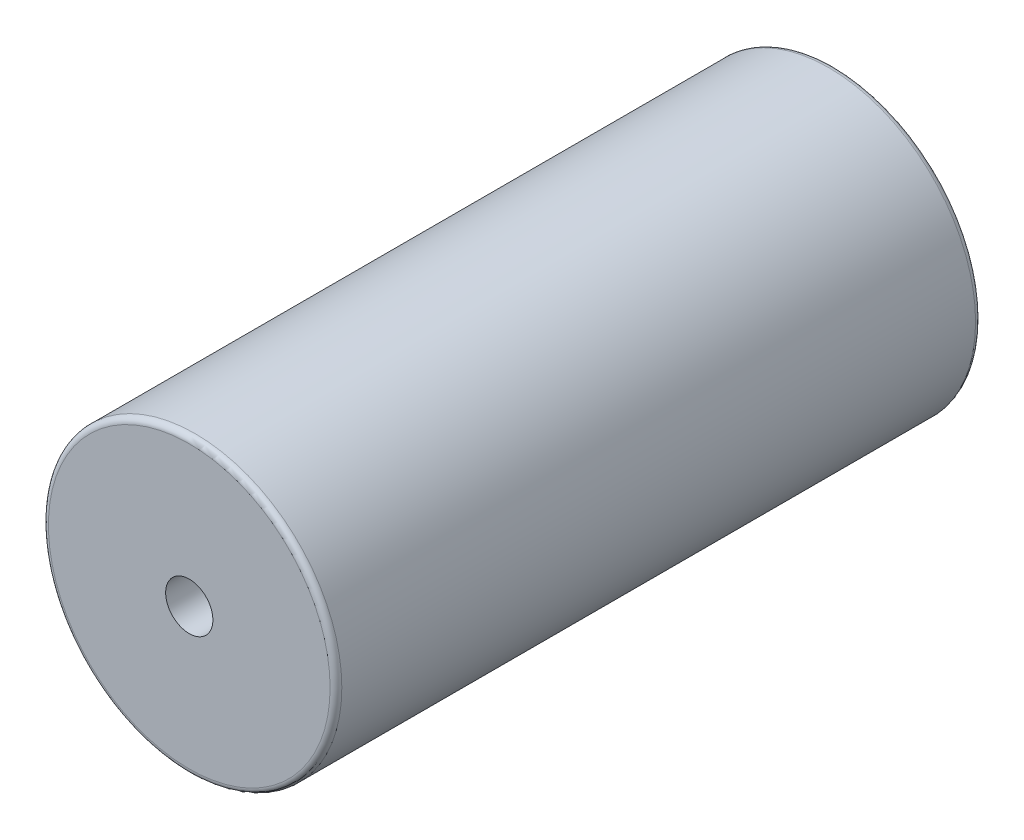
ISO-10303-21;
HEADER;
FILE_DESCRIPTION(('STEP AP214'),'2;1');
FILE_NAME('part.step','',(''),(''),'','','');
FILE_SCHEMA(('AUTOMOTIVE_DESIGN { 1 0 10303 214 1 1 1 1 }'));
ENDSEC;
DATA;
#1=APPLICATION_CONTEXT('core data for automotive mechanical design processes');
#2=APPLICATION_PROTOCOL_DEFINITION('international standard','automotive_design',2000,#1);
#3=PRODUCT_CONTEXT('',#1,'mechanical');
#4=PRODUCT('Part','Part','',(#3));
#5=PRODUCT_RELATED_PRODUCT_CATEGORY('part','',(#4));
#6=PRODUCT_DEFINITION_FORMATION('','',#4);
#7=PRODUCT_DEFINITION_CONTEXT('part definition',#1,'design');
#8=PRODUCT_DEFINITION('design','',#6,#7);
#9=PRODUCT_DEFINITION_SHAPE('','',#8);
#10=(LENGTH_UNIT() NAMED_UNIT(*) SI_UNIT(.MILLI.,.METRE.));
#11=(NAMED_UNIT(*) PLANE_ANGLE_UNIT() SI_UNIT($,.RADIAN.));
#12=(NAMED_UNIT(*) SI_UNIT($,.STERADIAN.) SOLID_ANGLE_UNIT());
#13=UNCERTAINTY_MEASURE_WITH_UNIT(LENGTH_MEASURE(1.E-05),#10,'distance_accuracy_value','');
#14=(GEOMETRIC_REPRESENTATION_CONTEXT(3) GLOBAL_UNCERTAINTY_ASSIGNED_CONTEXT((#13)) GLOBAL_UNIT_ASSIGNED_CONTEXT((#10,
#11,#12)) REPRESENTATION_CONTEXT('',''));
#15=CARTESIAN_POINT('',(0.,0.,0.));
#16=DIRECTION('',(0.,0.,1.));
#17=DIRECTION('',(1.,0.,0.));
#18=AXIS2_PLACEMENT_3D('',#15,#16,#17);
#19=CARTESIAN_POINT('',(0.,0.,110.));
#20=DIRECTION('',(0.,0.,1.));
#21=DIRECTION('',(1.,0.,0.));
#22=AXIS2_PLACEMENT_3D('',#19,#20,#21);
#23=PLANE('',#22);
#24=CARTESIAN_POINT('',(0.,0.,110.));
#25=DIRECTION('',(0.,0.,1.));
#26=DIRECTION('',(1.,0.,0.));
#27=AXIS2_PLACEMENT_3D('',#24,#25,#26);
#28=CIRCLE('',#27,24.);
#29=CARTESIAN_POINT('',(24.,0.,110.));
#30=VERTEX_POINT('',#29);
#31=EDGE_CURVE('E10',#30,#30,#28,.T.);
#32=ORIENTED_EDGE('',*,*,#31,.T.);
#33=EDGE_LOOP('',(#32));
#34=FACE_BOUND('',#33,.T.);
#35=CARTESIAN_POINT('',(0.,0.,110.));
#36=DIRECTION('',(0.,0.,1.));
#37=DIRECTION('',(1.,0.,0.));
#38=AXIS2_PLACEMENT_3D('',#35,#36,#37);
#39=CIRCLE('',#38,4.025);
#40=CARTESIAN_POINT('',(4.025,0.,110.));
#41=VERTEX_POINT('',#40);
#42=EDGE_CURVE('E51',#41,#41,#39,.T.);
#43=ORIENTED_EDGE('',*,*,#42,.F.);
#44=EDGE_LOOP('',(#43));
#45=FACE_BOUND('',#44,.T.);
#46=ADVANCED_FACE('F31',(#34,#45),#23,.T.);
#47=CARTESIAN_POINT('',(0.,0.,0.));
#48=DIRECTION('',(0.,0.,1.));
#49=DIRECTION('',(1.,0.,0.));
#50=AXIS2_PLACEMENT_3D('',#47,#48,#49);
#51=PLANE('',#50);
#52=CARTESIAN_POINT('',(0.,0.,0.));
#53=DIRECTION('',(0.,0.,1.));
#54=DIRECTION('',(1.,0.,0.));
#55=AXIS2_PLACEMENT_3D('',#52,#53,#54);
#56=CIRCLE('',#55,24.);
#57=CARTESIAN_POINT('',(24.,0.,0.));
#58=VERTEX_POINT('',#57);
#59=EDGE_CURVE('E38',#58,#58,#56,.F.);
#60=ORIENTED_EDGE('',*,*,#59,.T.);
#61=EDGE_LOOP('',(#60));
#62=FACE_BOUND('',#61,.T.);
#63=CARTESIAN_POINT('',(0.,0.,0.));
#64=DIRECTION('',(0.,0.,1.));
#65=DIRECTION('',(1.,0.,0.));
#66=AXIS2_PLACEMENT_3D('',#63,#64,#65);
#67=CIRCLE('',#66,4.025);
#68=CARTESIAN_POINT('',(4.025,0.,0.));
#69=VERTEX_POINT('',#68);
#70=EDGE_CURVE('E52',#69,#69,#67,.T.);
#71=ORIENTED_EDGE('',*,*,#70,.T.);
#72=EDGE_LOOP('',(#71));
#73=FACE_BOUND('',#72,.T.);
#74=ADVANCED_FACE('F62',(#62,#73),#51,.F.);
#75=CARTESIAN_POINT('',(0.,0.,110.));
#76=DIRECTION('',(0.,0.,-1.));
#77=DIRECTION('',(-1.,0.,0.));
#78=AXIS2_PLACEMENT_3D('',#75,#76,#77);
#79=CYLINDRICAL_SURFACE('',#78,25.);
#80=CARTESIAN_POINT('',(0.,0.,1.));
#81=DIRECTION('',(0.,0.,1.));
#82=DIRECTION('',(1.,0.,0.));
#83=AXIS2_PLACEMENT_3D('',#80,#81,#82);
#84=CIRCLE('',#83,25.);
#85=CARTESIAN_POINT('',(25.,0.,1.));
#86=VERTEX_POINT('',#85);
#87=EDGE_CURVE('E42',#86,#86,#84,.T.);
#88=ORIENTED_EDGE('',*,*,#87,.T.);
#89=EDGE_LOOP('',(#88));
#90=FACE_BOUND('',#89,.T.);
#91=CARTESIAN_POINT('',(0.,0.,109.));
#92=DIRECTION('',(0.,0.,1.));
#93=DIRECTION('',(1.,0.,0.));
#94=AXIS2_PLACEMENT_3D('',#91,#92,#93);
#95=CIRCLE('',#94,25.);
#96=CARTESIAN_POINT('',(25.,0.,109.));
#97=VERTEX_POINT('',#96);
#98=EDGE_CURVE('E46',#97,#97,#95,.F.);
#99=ORIENTED_EDGE('',*,*,#98,.T.);
#100=EDGE_LOOP('',(#99));
#101=FACE_BOUND('',#100,.T.);
#102=ADVANCED_FACE('F68',(#90,#101),#79,.T.);
#103=CARTESIAN_POINT('',(0.,0.,110.));
#104=DIRECTION('',(0.,0.,-1.));
#105=DIRECTION('',(-1.,0.,0.));
#106=AXIS2_PLACEMENT_3D('',#103,#104,#105);
#107=CYLINDRICAL_SURFACE('',#106,4.025);
#108=ORIENTED_EDGE('',*,*,#42,.T.);
#109=EDGE_LOOP('',(#108));
#110=FACE_BOUND('',#109,.T.);
#111=ORIENTED_EDGE('',*,*,#70,.F.);
#112=EDGE_LOOP('',(#111));
#113=FACE_BOUND('',#112,.T.);
#114=ADVANCED_FACE('F58',(#110,#113),#107,.F.);
#115=CARTESIAN_POINT('',(0.,0.,1.));
#116=DIRECTION('',(0.,0.,1.));
#117=DIRECTION('',(1.,0.,0.));
#118=AXIS2_PLACEMENT_3D('',#115,#116,#117);
#119=TOROIDAL_SURFACE('',#118,24.,1.);
#120=ORIENTED_EDGE('',*,*,#59,.F.);
#121=EDGE_LOOP('',(#120));
#122=FACE_BOUND('',#121,.T.);
#123=ORIENTED_EDGE('',*,*,#87,.F.);
#124=EDGE_LOOP('',(#123));
#125=FACE_BOUND('',#124,.T.);
#126=ADVANCED_FACE('F74',(#122,#125),#119,.T.);
#127=CARTESIAN_POINT('',(0.,0.,109.));
#128=DIRECTION('',(0.,0.,1.));
#129=DIRECTION('',(1.,0.,0.));
#130=AXIS2_PLACEMENT_3D('',#127,#128,#129);
#131=TOROIDAL_SURFACE('',#130,24.,1.);
#132=ORIENTED_EDGE('',*,*,#98,.F.);
#133=EDGE_LOOP('',(#132));
#134=FACE_BOUND('',#133,.T.);
#135=ORIENTED_EDGE('',*,*,#31,.F.);
#136=EDGE_LOOP('',(#135));
#137=FACE_BOUND('',#136,.T.);
#138=ADVANCED_FACE('F33',(#134,#137),#131,.T.);
#139=CLOSED_SHELL('',(#46,#74,#102,#114,#126,#138));
#140=MANIFOLD_SOLID_BREP('B2',#139);
#141=ADVANCED_BREP_SHAPE_REPRESENTATION('',(#18,#140),#14);
#142=SHAPE_DEFINITION_REPRESENTATION(#9,#141);
ENDSEC;
END-ISO-10303-21;
